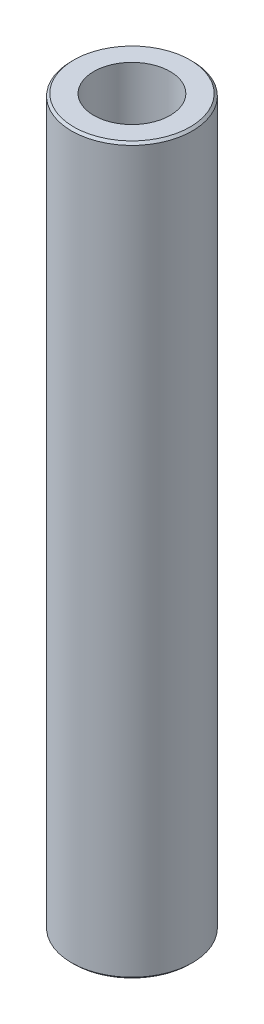
ISO-10303-21;
HEADER;
FILE_DESCRIPTION(('STEP AP214'),'2;1');
FILE_NAME('part.step','',(''),(''),'','','');
FILE_SCHEMA(('AUTOMOTIVE_DESIGN { 1 0 10303 214 1 1 1 1 }'));
ENDSEC;
DATA;
#1=APPLICATION_CONTEXT('core data for automotive mechanical design processes');
#2=APPLICATION_PROTOCOL_DEFINITION('international standard','automotive_design',2000,#1);
#3=PRODUCT_CONTEXT('',#1,'mechanical');
#4=PRODUCT('Part','Part','',(#3));
#5=PRODUCT_RELATED_PRODUCT_CATEGORY('part','',(#4));
#6=PRODUCT_DEFINITION_FORMATION('','',#4);
#7=PRODUCT_DEFINITION_CONTEXT('part definition',#1,'design');
#8=PRODUCT_DEFINITION('design','',#6,#7);
#9=PRODUCT_DEFINITION_SHAPE('','',#8);
#10=(LENGTH_UNIT() NAMED_UNIT(*) SI_UNIT(.MILLI.,.METRE.));
#11=(NAMED_UNIT(*) PLANE_ANGLE_UNIT() SI_UNIT($,.RADIAN.));
#12=(NAMED_UNIT(*) SI_UNIT($,.STERADIAN.) SOLID_ANGLE_UNIT());
#13=UNCERTAINTY_MEASURE_WITH_UNIT(LENGTH_MEASURE(1.E-05),#10,'distance_accuracy_value','');
#14=(GEOMETRIC_REPRESENTATION_CONTEXT(3) GLOBAL_UNCERTAINTY_ASSIGNED_CONTEXT((#13)) GLOBAL_UNIT_ASSIGNED_CONTEXT((#10,
#11,#12)) REPRESENTATION_CONTEXT('',''));
#15=CARTESIAN_POINT('',(0.,0.,0.));
#16=DIRECTION('',(0.,0.,1.));
#17=DIRECTION('',(1.,0.,0.));
#18=AXIS2_PLACEMENT_3D('',#15,#16,#17);
#19=CARTESIAN_POINT('',(0.,600.,0.));
#20=DIRECTION('',(0.,-1.,0.));
#21=DIRECTION('',(0.,0.,-1.));
#22=AXIS2_PLACEMENT_3D('',#19,#20,#21);
#23=CYLINDRICAL_SURFACE('',#22,50.);
#24=CARTESIAN_POINT('',(0.,598.113507714758,0.));
#25=DIRECTION('',(0.,1.,0.));
#26=DIRECTION('',(0.,0.,1.));
#27=AXIS2_PLACEMENT_3D('',#24,#25,#26);
#28=CIRCLE('',#27,50.);
#29=CARTESIAN_POINT('',(0.,598.113507714758,50.));
#30=VERTEX_POINT('',#29);
#31=EDGE_CURVE('E50',#30,#30,#28,.F.);
#32=ORIENTED_EDGE('',*,*,#31,.T.);
#33=EDGE_LOOP('',(#32));
#34=FACE_BOUND('',#33,.T.);
#35=CARTESIAN_POINT('',(0.,1.88649228524207,0.));
#36=DIRECTION('',(0.,1.,0.));
#37=DIRECTION('',(0.,0.,1.));
#38=AXIS2_PLACEMENT_3D('',#35,#36,#37);
#39=CIRCLE('',#38,50.);
#40=CARTESIAN_POINT('',(0.,1.88649228524207,50.));
#41=VERTEX_POINT('',#40);
#42=EDGE_CURVE('E51',#41,#41,#39,.T.);
#43=ORIENTED_EDGE('',*,*,#42,.T.);
#44=EDGE_LOOP('',(#43));
#45=FACE_BOUND('',#44,.T.);
#46=ADVANCED_FACE('F39',(#34,#45),#23,.T.);
#47=CARTESIAN_POINT('',(0.,600.,0.));
#48=DIRECTION('',(0.,1.,0.));
#49=DIRECTION('',(0.,0.,1.));
#50=AXIS2_PLACEMENT_3D('',#47,#48,#49);
#51=PLANE('',#50);
#52=CARTESIAN_POINT('',(0.,600.,0.));
#53=DIRECTION('',(0.,1.,0.));
#54=DIRECTION('',(0.,0.,1.));
#55=AXIS2_PLACEMENT_3D('',#52,#53,#54);
#56=CIRCLE('',#55,48.1135077147582);
#57=CARTESIAN_POINT('',(0.,600.,48.1135077147582));
#58=VERTEX_POINT('',#57);
#59=EDGE_CURVE('E54',#58,#58,#56,.T.);
#60=ORIENTED_EDGE('',*,*,#59,.T.);
#61=EDGE_LOOP('',(#60));
#62=FACE_BOUND('',#61,.T.);
#63=CARTESIAN_POINT('',(0.,600.,0.));
#64=DIRECTION('',(0.,1.,0.));
#65=DIRECTION('',(0.,0.,1.));
#66=AXIS2_PLACEMENT_3D('',#63,#64,#65);
#67=CIRCLE('',#66,31.5601790566375);
#68=CARTESIAN_POINT('',(0.,600.,31.5601790566375));
#69=VERTEX_POINT('',#68);
#70=EDGE_CURVE('E58',#69,#69,#67,.T.);
#71=ORIENTED_EDGE('',*,*,#70,.F.);
#72=EDGE_LOOP('',(#71));
#73=FACE_BOUND('',#72,.T.);
#74=ADVANCED_FACE('F69',(#62,#73),#51,.T.);
#75=CARTESIAN_POINT('',(0.,0.,0.));
#76=DIRECTION('',(0.,1.,0.));
#77=DIRECTION('',(0.,0.,1.));
#78=AXIS2_PLACEMENT_3D('',#75,#76,#77);
#79=PLANE('',#78);
#80=CARTESIAN_POINT('',(0.,0.,0.));
#81=DIRECTION('',(0.,1.,0.));
#82=DIRECTION('',(0.,0.,1.));
#83=AXIS2_PLACEMENT_3D('',#80,#81,#82);
#84=CIRCLE('',#83,48.1135077147579);
#85=CARTESIAN_POINT('',(0.,0.,48.1135077147579));
#86=VERTEX_POINT('',#85);
#87=EDGE_CURVE('E10',#86,#86,#84,.F.);
#88=ORIENTED_EDGE('',*,*,#87,.T.);
#89=EDGE_LOOP('',(#88));
#90=FACE_BOUND('',#89,.T.);
#91=CARTESIAN_POINT('',(0.,0.,0.));
#92=DIRECTION('',(0.,1.,0.));
#93=DIRECTION('',(0.,0.,1.));
#94=AXIS2_PLACEMENT_3D('',#91,#92,#93);
#95=CIRCLE('',#94,31.5601790566375);
#96=CARTESIAN_POINT('',(0.,0.,31.5601790566375));
#97=VERTEX_POINT('',#96);
#98=EDGE_CURVE('E63',#97,#97,#95,.T.);
#99=ORIENTED_EDGE('',*,*,#98,.T.);
#100=EDGE_LOOP('',(#99));
#101=FACE_BOUND('',#100,.T.);
#102=ADVANCED_FACE('F75',(#90,#101),#79,.F.);
#103=CARTESIAN_POINT('',(0.,600.,0.));
#104=DIRECTION('',(0.,-1.,0.));
#105=DIRECTION('',(0.,0.,-1.));
#106=AXIS2_PLACEMENT_3D('',#103,#104,#105);
#107=CYLINDRICAL_SURFACE('',#106,31.5601790566375);
#108=ORIENTED_EDGE('',*,*,#70,.T.);
#109=EDGE_LOOP('',(#108));
#110=FACE_BOUND('',#109,.T.);
#111=ORIENTED_EDGE('',*,*,#98,.F.);
#112=EDGE_LOOP('',(#111));
#113=FACE_BOUND('',#112,.T.);
#114=ADVANCED_FACE('F70',(#110,#113),#107,.F.);
#115=CARTESIAN_POINT('',(0.,600.,0.));
#116=DIRECTION('',(0.,-1.,0.));
#117=DIRECTION('',(0.,0.,-1.));
#118=AXIS2_PLACEMENT_3D('',#115,#116,#117);
#119=CONICAL_SURFACE('',#118,48.1135077147582,0.785398163397435);
#120=ORIENTED_EDGE('',*,*,#31,.F.);
#121=EDGE_LOOP('',(#120));
#122=FACE_BOUND('',#121,.T.);
#123=ORIENTED_EDGE('',*,*,#59,.F.);
#124=EDGE_LOOP('',(#123));
#125=FACE_BOUND('',#124,.T.);
#126=ADVANCED_FACE('F81',(#122,#125),#119,.T.);
#127=CARTESIAN_POINT('',(0.,1.88649228524207,0.));
#128=DIRECTION('',(0.,1.,0.));
#129=DIRECTION('',(0.,0.,1.));
#130=AXIS2_PLACEMENT_3D('',#127,#128,#129);
#131=CONICAL_SURFACE('',#130,50.,0.78539816339745);
#132=ORIENTED_EDGE('',*,*,#87,.F.);
#133=EDGE_LOOP('',(#132));
#134=FACE_BOUND('',#133,.T.);
#135=ORIENTED_EDGE('',*,*,#42,.F.);
#136=EDGE_LOOP('',(#135));
#137=FACE_BOUND('',#136,.T.);
#138=ADVANCED_FACE('F45',(#134,#137),#131,.T.);
#139=CLOSED_SHELL('',(#46,#74,#102,#114,#126,#138));
#140=MANIFOLD_SOLID_BREP('B2',#139);
#141=ADVANCED_BREP_SHAPE_REPRESENTATION('',(#18,#140),#14);
#142=SHAPE_DEFINITION_REPRESENTATION(#9,#141);
ENDSEC;
END-ISO-10303-21;
